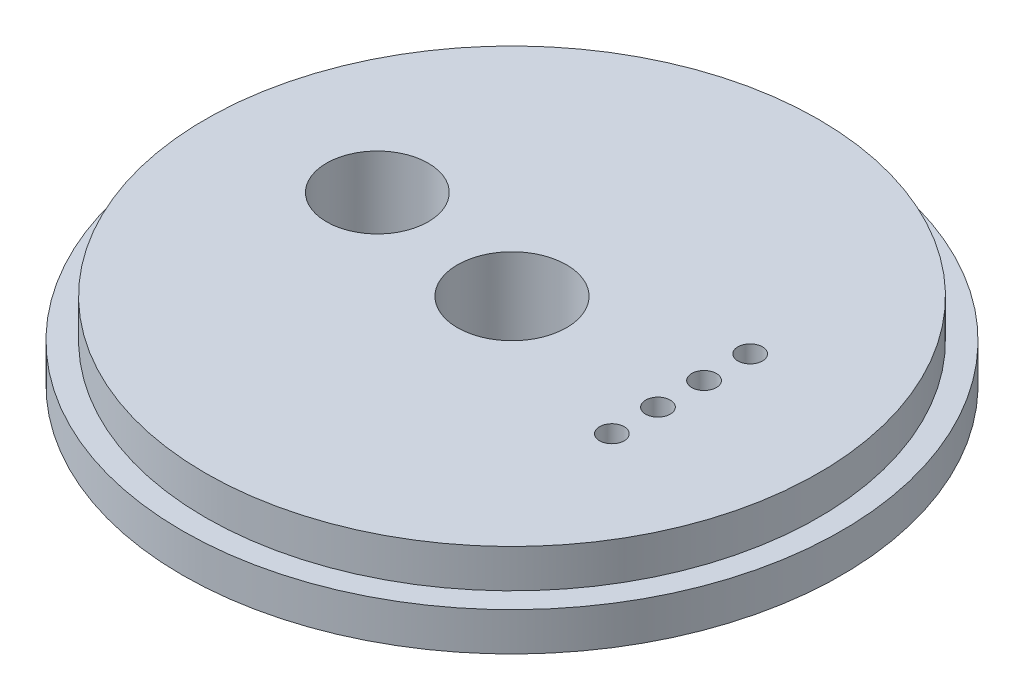
ISO-10303-21;
HEADER;
FILE_DESCRIPTION(('STEP AP214'),'2;1');
FILE_NAME('part.step','',(''),(''),'','','');
FILE_SCHEMA(('AUTOMOTIVE_DESIGN { 1 0 10303 214 1 1 1 1 }'));
ENDSEC;
DATA;
#1=APPLICATION_CONTEXT('core data for automotive mechanical design processes');
#2=APPLICATION_PROTOCOL_DEFINITION('international standard','automotive_design',2000,#1);
#3=PRODUCT_CONTEXT('',#1,'mechanical');
#4=PRODUCT('Part','Part','',(#3));
#5=PRODUCT_RELATED_PRODUCT_CATEGORY('part','',(#4));
#6=PRODUCT_DEFINITION_FORMATION('','',#4);
#7=PRODUCT_DEFINITION_CONTEXT('part definition',#1,'design');
#8=PRODUCT_DEFINITION('design','',#6,#7);
#9=PRODUCT_DEFINITION_SHAPE('','',#8);
#10=(LENGTH_UNIT() NAMED_UNIT(*) SI_UNIT(.MILLI.,.METRE.));
#11=(NAMED_UNIT(*) PLANE_ANGLE_UNIT() SI_UNIT($,.RADIAN.));
#12=(NAMED_UNIT(*) SI_UNIT($,.STERADIAN.) SOLID_ANGLE_UNIT());
#13=UNCERTAINTY_MEASURE_WITH_UNIT(LENGTH_MEASURE(1.E-05),#10,'distance_accuracy_value','');
#14=(GEOMETRIC_REPRESENTATION_CONTEXT(3) GLOBAL_UNCERTAINTY_ASSIGNED_CONTEXT((#13)) GLOBAL_UNIT_ASSIGNED_CONTEXT((#10,
#11,#12)) REPRESENTATION_CONTEXT('',''));
#15=CARTESIAN_POINT('',(0.,0.,0.));
#16=DIRECTION('',(0.,0.,1.));
#17=DIRECTION('',(1.,0.,0.));
#18=AXIS2_PLACEMENT_3D('',#15,#16,#17);
#19=CARTESIAN_POINT('',(0.,3.175,0.));
#20=DIRECTION('',(0.,-1.,0.));
#21=DIRECTION('',(0.,0.,-1.));
#22=AXIS2_PLACEMENT_3D('',#19,#20,#21);
#23=CYLINDRICAL_SURFACE('',#22,27.2415);
#24=CARTESIAN_POINT('',(0.,3.175,0.));
#25=DIRECTION('',(0.,1.,0.));
#26=DIRECTION('',(0.,0.,1.));
#27=AXIS2_PLACEMENT_3D('',#24,#25,#26);
#28=CIRCLE('',#27,27.2415);
#29=CARTESIAN_POINT('',(0.,3.175,27.2415));
#30=VERTEX_POINT('',#29);
#31=EDGE_CURVE('E48',#30,#30,#28,.T.);
#32=ORIENTED_EDGE('',*,*,#31,.F.);
#33=EDGE_LOOP('',(#32));
#34=FACE_BOUND('',#33,.T.);
#35=CARTESIAN_POINT('',(0.,0.,0.));
#36=DIRECTION('',(0.,1.,0.));
#37=DIRECTION('',(0.,0.,1.));
#38=AXIS2_PLACEMENT_3D('',#35,#36,#37);
#39=CIRCLE('',#38,27.2415);
#40=CARTESIAN_POINT('',(0.,0.,27.2415));
#41=VERTEX_POINT('',#40);
#42=EDGE_CURVE('E43',#41,#41,#39,.T.);
#43=ORIENTED_EDGE('',*,*,#42,.T.);
#44=EDGE_LOOP('',(#43));
#45=FACE_BOUND('',#44,.T.);
#46=ADVANCED_FACE('F40',(#34,#45),#23,.T.);
#47=CARTESIAN_POINT('',(0.,3.175,0.));
#48=DIRECTION('',(0.,1.,0.));
#49=DIRECTION('',(0.,0.,1.));
#50=AXIS2_PLACEMENT_3D('',#47,#48,#49);
#51=PLANE('',#50);
#52=CARTESIAN_POINT('',(0.,3.175,0.));
#53=DIRECTION('',(0.,1.,0.));
#54=DIRECTION('',(0.,0.,1.));
#55=AXIS2_PLACEMENT_3D('',#52,#53,#54);
#56=CIRCLE('',#55,25.3365);
#57=CARTESIAN_POINT('',(0.,3.175,25.3365));
#58=VERTEX_POINT('',#57);
#59=EDGE_CURVE('E10',#58,#58,#56,.T.);
#60=ORIENTED_EDGE('',*,*,#59,.F.);
#61=EDGE_LOOP('',(#60));
#62=FACE_BOUND('',#61,.T.);
#63=ORIENTED_EDGE('',*,*,#31,.T.);
#64=EDGE_LOOP('',(#63));
#65=FACE_BOUND('',#64,.T.);
#66=ADVANCED_FACE('F137',(#62,#65),#51,.T.);
#67=CARTESIAN_POINT('',(0.,0.,0.));
#68=DIRECTION('',(0.,1.,0.));
#69=DIRECTION('',(0.,0.,1.));
#70=AXIS2_PLACEMENT_3D('',#67,#68,#69);
#71=PLANE('',#70);
#72=CARTESIAN_POINT('',(13.97,0.,-5.715));
#73=DIRECTION('',(0.,1.,0.));
#74=DIRECTION('',(0.,0.,1.));
#75=AXIS2_PLACEMENT_3D('',#72,#73,#74);
#76=CIRCLE('',#75,1.016);
#77=CARTESIAN_POINT('',(13.97,0.,-4.699));
#78=VERTEX_POINT('',#77);
#79=EDGE_CURVE('E72',#78,#78,#76,.F.);
#80=ORIENTED_EDGE('',*,*,#79,.F.);
#81=EDGE_LOOP('',(#80));
#82=FACE_BOUND('',#81,.T.);
#83=CARTESIAN_POINT('',(13.97,0.,-1.905));
#84=DIRECTION('',(0.,1.,0.));
#85=DIRECTION('',(0.,0.,1.));
#86=AXIS2_PLACEMENT_3D('',#83,#84,#85);
#87=CIRCLE('',#86,1.016);
#88=CARTESIAN_POINT('',(13.97,0.,-0.888999999999999));
#89=VERTEX_POINT('',#88);
#90=EDGE_CURVE('E89',#89,#89,#87,.F.);
#91=ORIENTED_EDGE('',*,*,#90,.F.);
#92=EDGE_LOOP('',(#91));
#93=FACE_BOUND('',#92,.T.);
#94=CARTESIAN_POINT('',(13.97,0.,1.905));
#95=DIRECTION('',(0.,1.,0.));
#96=DIRECTION('',(0.,0.,1.));
#97=AXIS2_PLACEMENT_3D('',#94,#95,#96);
#98=CIRCLE('',#97,1.016);
#99=CARTESIAN_POINT('',(13.97,0.,2.921));
#100=VERTEX_POINT('',#99);
#101=EDGE_CURVE('E80',#100,#100,#98,.F.);
#102=ORIENTED_EDGE('',*,*,#101,.F.);
#103=EDGE_LOOP('',(#102));
#104=FACE_BOUND('',#103,.T.);
#105=CARTESIAN_POINT('',(13.97,0.,5.715));
#106=DIRECTION('',(0.,1.,0.));
#107=DIRECTION('',(0.,0.,1.));
#108=AXIS2_PLACEMENT_3D('',#105,#106,#107);
#109=CIRCLE('',#108,1.016);
#110=CARTESIAN_POINT('',(13.97,0.,6.731));
#111=VERTEX_POINT('',#110);
#112=EDGE_CURVE('E81',#111,#111,#109,.F.);
#113=ORIENTED_EDGE('',*,*,#112,.F.);
#114=EDGE_LOOP('',(#113));
#115=FACE_BOUND('',#114,.T.);
#116=CARTESIAN_POINT('',(0.,0.,0.));
#117=DIRECTION('',(0.,-1.,0.));
#118=DIRECTION('',(0.,0.,-1.));
#119=AXIS2_PLACEMENT_3D('',#116,#117,#118);
#120=CIRCLE('',#119,4.5085);
#121=CARTESIAN_POINT('',(0.,0.,-4.5085));
#122=VERTEX_POINT('',#121);
#123=EDGE_CURVE('E67',#122,#122,#120,.T.);
#124=ORIENTED_EDGE('',*,*,#123,.F.);
#125=EDGE_LOOP('',(#124));
#126=FACE_BOUND('',#125,.T.);
#127=CARTESIAN_POINT('',(-12.992582174577,0.,-1.86297362329767));
#128=DIRECTION('',(0.,-1.,0.));
#129=DIRECTION('',(0.,0.,-1.));
#130=AXIS2_PLACEMENT_3D('',#127,#128,#129);
#131=CIRCLE('',#130,4.2037);
#132=CARTESIAN_POINT('',(-12.992582174577,0.,-6.06667362329767));
#133=VERTEX_POINT('',#132);
#134=EDGE_CURVE('E63',#133,#133,#131,.T.);
#135=ORIENTED_EDGE('',*,*,#134,.F.);
#136=EDGE_LOOP('',(#135));
#137=FACE_BOUND('',#136,.T.);
#138=ORIENTED_EDGE('',*,*,#42,.F.);
#139=EDGE_LOOP('',(#138));
#140=FACE_BOUND('',#139,.T.);
#141=ADVANCED_FACE('F130',(#82,#93,#104,#115,#126,#137,#140),#71,.F.);
#142=CARTESIAN_POINT('',(0.,6.35,0.));
#143=DIRECTION('',(0.,-1.,0.));
#144=DIRECTION('',(0.,0.,-1.));
#145=AXIS2_PLACEMENT_3D('',#142,#143,#144);
#146=CYLINDRICAL_SURFACE('',#145,25.3365);
#147=CARTESIAN_POINT('',(0.,6.35,0.));
#148=DIRECTION('',(0.,1.,0.));
#149=DIRECTION('',(0.,0.,1.));
#150=AXIS2_PLACEMENT_3D('',#147,#148,#149);
#151=CIRCLE('',#150,25.3365);
#152=CARTESIAN_POINT('',(0.,6.35,25.3365));
#153=VERTEX_POINT('',#152);
#154=EDGE_CURVE('E55',#153,#153,#151,.T.);
#155=ORIENTED_EDGE('',*,*,#154,.F.);
#156=EDGE_LOOP('',(#155));
#157=FACE_BOUND('',#156,.T.);
#158=ORIENTED_EDGE('',*,*,#59,.T.);
#159=EDGE_LOOP('',(#158));
#160=FACE_BOUND('',#159,.T.);
#161=ADVANCED_FACE('F115',(#157,#160),#146,.T.);
#162=CARTESIAN_POINT('',(0.,6.35,0.));
#163=DIRECTION('',(0.,1.,0.));
#164=DIRECTION('',(0.,0.,1.));
#165=AXIS2_PLACEMENT_3D('',#162,#163,#164);
#166=PLANE('',#165);
#167=CARTESIAN_POINT('',(13.97,6.35,-5.715));
#168=DIRECTION('',(0.,1.,0.));
#169=DIRECTION('',(0.,0.,1.));
#170=AXIS2_PLACEMENT_3D('',#167,#168,#169);
#171=CIRCLE('',#170,1.016);
#172=CARTESIAN_POINT('',(13.97,6.35,-4.699));
#173=VERTEX_POINT('',#172);
#174=EDGE_CURVE('E97',#173,#173,#171,.T.);
#175=ORIENTED_EDGE('',*,*,#174,.F.);
#176=EDGE_LOOP('',(#175));
#177=FACE_BOUND('',#176,.T.);
#178=CARTESIAN_POINT('',(13.97,6.35,-1.905));
#179=DIRECTION('',(0.,1.,0.));
#180=DIRECTION('',(0.,0.,1.));
#181=AXIS2_PLACEMENT_3D('',#178,#179,#180);
#182=CIRCLE('',#181,1.016);
#183=CARTESIAN_POINT('',(13.97,6.35,-0.888999999999999));
#184=VERTEX_POINT('',#183);
#185=EDGE_CURVE('E93',#184,#184,#182,.T.);
#186=ORIENTED_EDGE('',*,*,#185,.F.);
#187=EDGE_LOOP('',(#186));
#188=FACE_BOUND('',#187,.T.);
#189=CARTESIAN_POINT('',(13.97,6.35,1.905));
#190=DIRECTION('',(0.,1.,0.));
#191=DIRECTION('',(0.,0.,1.));
#192=AXIS2_PLACEMENT_3D('',#189,#190,#191);
#193=CIRCLE('',#192,1.016);
#194=CARTESIAN_POINT('',(13.97,6.35,2.921));
#195=VERTEX_POINT('',#194);
#196=EDGE_CURVE('E85',#195,#195,#193,.T.);
#197=ORIENTED_EDGE('',*,*,#196,.F.);
#198=EDGE_LOOP('',(#197));
#199=FACE_BOUND('',#198,.T.);
#200=CARTESIAN_POINT('',(13.97,6.35,5.715));
#201=DIRECTION('',(0.,1.,0.));
#202=DIRECTION('',(0.,0.,1.));
#203=AXIS2_PLACEMENT_3D('',#200,#201,#202);
#204=CIRCLE('',#203,1.016);
#205=CARTESIAN_POINT('',(13.97,6.35,6.731));
#206=VERTEX_POINT('',#205);
#207=EDGE_CURVE('E76',#206,#206,#204,.T.);
#208=ORIENTED_EDGE('',*,*,#207,.F.);
#209=EDGE_LOOP('',(#208));
#210=FACE_BOUND('',#209,.T.);
#211=CARTESIAN_POINT('',(0.,6.35,0.));
#212=DIRECTION('',(0.,1.,0.));
#213=DIRECTION('',(0.,0.,1.));
#214=AXIS2_PLACEMENT_3D('',#211,#212,#213);
#215=CIRCLE('',#214,4.5085);
#216=CARTESIAN_POINT('',(0.,6.35,4.5085));
#217=VERTEX_POINT('',#216);
#218=EDGE_CURVE('E68',#217,#217,#215,.F.);
#219=ORIENTED_EDGE('',*,*,#218,.T.);
#220=EDGE_LOOP('',(#219));
#221=FACE_BOUND('',#220,.T.);
#222=CARTESIAN_POINT('',(-12.992582174577,6.35,-1.86297362329767));
#223=DIRECTION('',(0.,1.,0.));
#224=DIRECTION('',(0.,0.,1.));
#225=AXIS2_PLACEMENT_3D('',#222,#223,#224);
#226=CIRCLE('',#225,4.2037);
#227=CARTESIAN_POINT('',(-12.992582174577,6.35,2.34072637670233));
#228=VERTEX_POINT('',#227);
#229=EDGE_CURVE('E59',#228,#228,#226,.F.);
#230=ORIENTED_EDGE('',*,*,#229,.T.);
#231=EDGE_LOOP('',(#230));
#232=FACE_BOUND('',#231,.T.);
#233=ORIENTED_EDGE('',*,*,#154,.T.);
#234=EDGE_LOOP('',(#233));
#235=FACE_BOUND('',#234,.T.);
#236=ADVANCED_FACE('F111',(#177,#188,#199,#210,#221,#232,#235),#166,.T.);
#237=CARTESIAN_POINT('',(-12.992582174577,18.2398591042956,-1.86297362329767));
#238=DIRECTION('',(0.,-1.,0.));
#239=DIRECTION('',(0.,0.,-1.));
#240=AXIS2_PLACEMENT_3D('',#237,#238,#239);
#241=CYLINDRICAL_SURFACE('',#240,4.2037);
#242=ORIENTED_EDGE('',*,*,#134,.T.);
#243=EDGE_LOOP('',(#242));
#244=FACE_BOUND('',#243,.T.);
#245=ORIENTED_EDGE('',*,*,#229,.F.);
#246=EDGE_LOOP('',(#245));
#247=FACE_BOUND('',#246,.T.);
#248=ADVANCED_FACE('F114',(#244,#247),#241,.F.);
#249=CARTESIAN_POINT('',(0.,6.351,0.));
#250=DIRECTION('',(0.,-1.,0.));
#251=DIRECTION('',(0.,0.,-1.));
#252=AXIS2_PLACEMENT_3D('',#249,#250,#251);
#253=CYLINDRICAL_SURFACE('',#252,4.5085);
#254=ORIENTED_EDGE('',*,*,#218,.F.);
#255=EDGE_LOOP('',(#254));
#256=FACE_BOUND('',#255,.T.);
#257=ORIENTED_EDGE('',*,*,#123,.T.);
#258=EDGE_LOOP('',(#257));
#259=FACE_BOUND('',#258,.T.);
#260=ADVANCED_FACE('F165',(#256,#259),#253,.F.);
#261=CARTESIAN_POINT('',(13.97,-0.00100000000000013,5.715));
#262=DIRECTION('',(0.,1.,0.));
#263=DIRECTION('',(0.,0.,1.));
#264=AXIS2_PLACEMENT_3D('',#261,#262,#263);
#265=CYLINDRICAL_SURFACE('',#264,1.016);
#266=ORIENTED_EDGE('',*,*,#207,.T.);
#267=EDGE_LOOP('',(#266));
#268=FACE_BOUND('',#267,.T.);
#269=ORIENTED_EDGE('',*,*,#112,.T.);
#270=EDGE_LOOP('',(#269));
#271=FACE_BOUND('',#270,.T.);
#272=ADVANCED_FACE('F175',(#268,#271),#265,.F.);
#273=CARTESIAN_POINT('',(13.97,-0.00100000000000013,1.905));
#274=DIRECTION('',(0.,1.,0.));
#275=DIRECTION('',(0.,0.,1.));
#276=AXIS2_PLACEMENT_3D('',#273,#274,#275);
#277=CYLINDRICAL_SURFACE('',#276,1.016);
#278=ORIENTED_EDGE('',*,*,#196,.T.);
#279=EDGE_LOOP('',(#278));
#280=FACE_BOUND('',#279,.T.);
#281=ORIENTED_EDGE('',*,*,#101,.T.);
#282=EDGE_LOOP('',(#281));
#283=FACE_BOUND('',#282,.T.);
#284=ADVANCED_FACE('F180',(#280,#283),#277,.F.);
#285=CARTESIAN_POINT('',(13.97,-0.00100000000000013,-1.905));
#286=DIRECTION('',(0.,1.,0.));
#287=DIRECTION('',(0.,0.,1.));
#288=AXIS2_PLACEMENT_3D('',#285,#286,#287);
#289=CYLINDRICAL_SURFACE('',#288,1.016);
#290=ORIENTED_EDGE('',*,*,#185,.T.);
#291=EDGE_LOOP('',(#290));
#292=FACE_BOUND('',#291,.T.);
#293=ORIENTED_EDGE('',*,*,#90,.T.);
#294=EDGE_LOOP('',(#293));
#295=FACE_BOUND('',#294,.T.);
#296=ADVANCED_FACE('F191',(#292,#295),#289,.F.);
#297=CARTESIAN_POINT('',(13.97,-0.00100000000000013,-5.715));
#298=DIRECTION('',(0.,1.,0.));
#299=DIRECTION('',(0.,0.,1.));
#300=AXIS2_PLACEMENT_3D('',#297,#298,#299);
#301=CYLINDRICAL_SURFACE('',#300,1.016);
#302=ORIENTED_EDGE('',*,*,#174,.T.);
#303=EDGE_LOOP('',(#302));
#304=FACE_BOUND('',#303,.T.);
#305=ORIENTED_EDGE('',*,*,#79,.T.);
#306=EDGE_LOOP('',(#305));
#307=FACE_BOUND('',#306,.T.);
#308=ADVANCED_FACE('F108',(#304,#307),#301,.F.);
#309=CLOSED_SHELL('',(#46,#66,#141,#161,#236,#248,#260,#272,#284,#296,#308));
#310=MANIFOLD_SOLID_BREP('B2',#309);
#311=ADVANCED_BREP_SHAPE_REPRESENTATION('',(#18,#310),#14);
#312=SHAPE_DEFINITION_REPRESENTATION(#9,#311);
ENDSEC;
END-ISO-10303-21;
